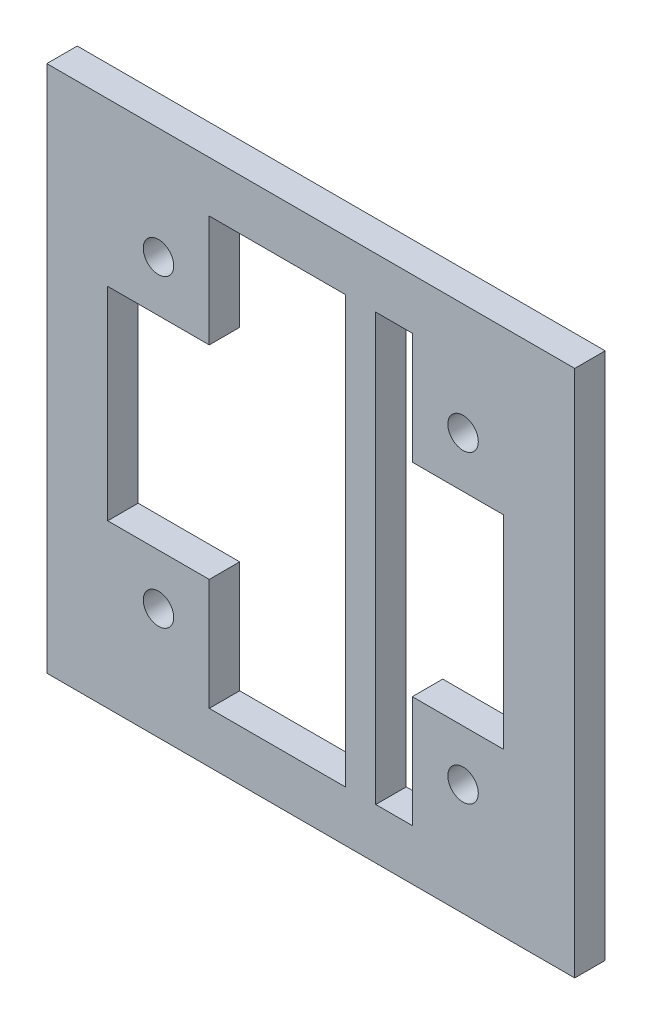
ISO-10303-21;
HEADER;
FILE_DESCRIPTION(('STEP AP214'),'2;1');
FILE_NAME('part.step','',(''),(''),'','','');
FILE_SCHEMA(('AUTOMOTIVE_DESIGN { 1 0 10303 214 1 1 1 1 }'));
ENDSEC;
DATA;
#1=APPLICATION_CONTEXT('core data for automotive mechanical design processes');
#2=APPLICATION_PROTOCOL_DEFINITION('international standard','automotive_design',2000,#1);
#3=PRODUCT_CONTEXT('',#1,'mechanical');
#4=PRODUCT('Part','Part','',(#3));
#5=PRODUCT_RELATED_PRODUCT_CATEGORY('part','',(#4));
#6=PRODUCT_DEFINITION_FORMATION('','',#4);
#7=PRODUCT_DEFINITION_CONTEXT('part definition',#1,'design');
#8=PRODUCT_DEFINITION('design','',#6,#7);
#9=PRODUCT_DEFINITION_SHAPE('','',#8);
#10=(LENGTH_UNIT() NAMED_UNIT(*) SI_UNIT(.MILLI.,.METRE.));
#11=(NAMED_UNIT(*) PLANE_ANGLE_UNIT() SI_UNIT($,.RADIAN.));
#12=(NAMED_UNIT(*) SI_UNIT($,.STERADIAN.) SOLID_ANGLE_UNIT());
#13=UNCERTAINTY_MEASURE_WITH_UNIT(LENGTH_MEASURE(1.E-05),#10,'distance_accuracy_value','');
#14=(GEOMETRIC_REPRESENTATION_CONTEXT(3) GLOBAL_UNCERTAINTY_ASSIGNED_CONTEXT((#13)) GLOBAL_UNIT_ASSIGNED_CONTEXT((#10,
#11,#12)) REPRESENTATION_CONTEXT('',''));
#15=CARTESIAN_POINT('',(0.,0.,0.));
#16=DIRECTION('',(0.,0.,1.));
#17=DIRECTION('',(1.,0.,0.));
#18=AXIS2_PLACEMENT_3D('',#15,#16,#17);
#19=CARTESIAN_POINT('',(72.4,0.,3.));
#20=DIRECTION('',(1.,0.,0.));
#21=DIRECTION('',(0.,0.,-1.));
#22=AXIS2_PLACEMENT_3D('',#19,#20,#21);
#23=PLANE('',#22);
#24=DIRECTION('',(0.,-1.,0.));
#25=VECTOR('',#24,1.);
#26=CARTESIAN_POINT('',(72.4,0.,0.));
#27=LINE('',#26,#25);
#28=CARTESIAN_POINT('',(72.4,226.,0.));
#29=VERTEX_POINT('',#28);
#30=CARTESIAN_POINT('',(72.4,184.,0.));
#31=VERTEX_POINT('',#30);
#32=EDGE_CURVE('E253',#29,#31,#27,.T.);
#33=ORIENTED_EDGE('',*,*,#32,.F.);
#34=DIRECTION('',(0.,0.,-1.));
#35=VECTOR('',#34,1.);
#36=CARTESIAN_POINT('',(72.4,226.,3.));
#37=LINE('',#36,#35);
#38=CARTESIAN_POINT('',(72.4,226.,3.));
#39=VERTEX_POINT('',#38);
#40=EDGE_CURVE('E11',#39,#29,#37,.T.);
#41=ORIENTED_EDGE('',*,*,#40,.F.);
#42=DIRECTION('',(0.,-1.,0.));
#43=VECTOR('',#42,1.);
#44=CARTESIAN_POINT('',(72.4,0.,3.));
#45=LINE('',#44,#43);
#46=CARTESIAN_POINT('',(72.4,184.,3.));
#47=VERTEX_POINT('',#46);
#48=EDGE_CURVE('E597',#39,#47,#45,.T.);
#49=ORIENTED_EDGE('',*,*,#48,.T.);
#50=DIRECTION('',(0.,0.,-1.));
#51=VECTOR('',#50,1.);
#52=CARTESIAN_POINT('',(72.4,184.,3.));
#53=LINE('',#52,#51);
#54=EDGE_CURVE('E51',#47,#31,#53,.T.);
#55=ORIENTED_EDGE('',*,*,#54,.T.);
#56=EDGE_LOOP('',(#33,#41,#49,#55));
#57=FACE_BOUND('',#56,.T.);
#58=ADVANCED_FACE('F32',(#57),#23,.T.);
#59=CARTESIAN_POINT('',(0.,226.,3.));
#60=DIRECTION('',(0.,1.,0.));
#61=DIRECTION('',(0.,0.,1.));
#62=AXIS2_PLACEMENT_3D('',#59,#60,#61);
#63=PLANE('',#62);
#64=DIRECTION('',(1.,0.,0.));
#65=VECTOR('',#64,1.);
#66=CARTESIAN_POINT('',(0.,226.,0.));
#67=LINE('',#66,#65);
#68=CARTESIAN_POINT('',(76.,226.,0.));
#69=VERTEX_POINT('',#68);
#70=EDGE_CURVE('E255',#29,#69,#67,.T.);
#71=ORIENTED_EDGE('',*,*,#70,.T.);
#72=DIRECTION('',(0.,0.,-1.));
#73=VECTOR('',#72,1.);
#74=CARTESIAN_POINT('',(76.,226.,3.));
#75=LINE('',#74,#73);
#76=CARTESIAN_POINT('',(76.,226.,3.));
#77=VERTEX_POINT('',#76);
#78=EDGE_CURVE('E42',#77,#69,#75,.T.);
#79=ORIENTED_EDGE('',*,*,#78,.F.);
#80=DIRECTION('',(1.,0.,0.));
#81=VECTOR('',#80,1.);
#82=CARTESIAN_POINT('',(0.,226.,3.));
#83=LINE('',#82,#81);
#84=EDGE_CURVE('E595',#39,#77,#83,.T.);
#85=ORIENTED_EDGE('',*,*,#84,.F.);
#86=ORIENTED_EDGE('',*,*,#40,.T.);
#87=EDGE_LOOP('',(#71,#79,#85,#86));
#88=FACE_BOUND('',#87,.T.);
#89=ADVANCED_FACE('F358',(#88),#63,.F.);
#90=CARTESIAN_POINT('',(76.,0.,3.));
#91=DIRECTION('',(1.,0.,0.));
#92=DIRECTION('',(0.,0.,-1.));
#93=AXIS2_PLACEMENT_3D('',#90,#91,#92);
#94=PLANE('',#93);
#95=DIRECTION('',(0.,-1.,0.));
#96=VECTOR('',#95,1.);
#97=CARTESIAN_POINT('',(76.,0.,0.));
#98=LINE('',#97,#96);
#99=CARTESIAN_POINT('',(76.,215.,0.));
#100=VERTEX_POINT('',#99);
#101=EDGE_CURVE('E258',#69,#100,#98,.T.);
#102=ORIENTED_EDGE('',*,*,#101,.T.);
#103=DIRECTION('',(0.,0.,-1.));
#104=VECTOR('',#103,1.);
#105=CARTESIAN_POINT('',(76.,215.,3.));
#106=LINE('',#105,#104);
#107=CARTESIAN_POINT('',(76.,215.,3.));
#108=VERTEX_POINT('',#107);
#109=EDGE_CURVE('E280',#108,#100,#106,.T.);
#110=ORIENTED_EDGE('',*,*,#109,.F.);
#111=DIRECTION('',(0.,-1.,0.));
#112=VECTOR('',#111,1.);
#113=CARTESIAN_POINT('',(76.,0.,3.));
#114=LINE('',#113,#112);
#115=EDGE_CURVE('E592',#77,#108,#114,.T.);
#116=ORIENTED_EDGE('',*,*,#115,.F.);
#117=ORIENTED_EDGE('',*,*,#78,.T.);
#118=EDGE_LOOP('',(#102,#110,#116,#117));
#119=FACE_BOUND('',#118,.T.);
#120=ADVANCED_FACE('F363',(#119),#94,.F.);
#121=CARTESIAN_POINT('',(0.,215.,3.));
#122=DIRECTION('',(0.,1.,0.));
#123=DIRECTION('',(0.,0.,1.));
#124=AXIS2_PLACEMENT_3D('',#121,#122,#123);
#125=PLANE('',#124);
#126=DIRECTION('',(1.,0.,0.));
#127=VECTOR('',#126,1.);
#128=CARTESIAN_POINT('',(0.,215.,0.));
#129=LINE('',#128,#127);
#130=CARTESIAN_POINT('',(85.,215.,0.));
#131=VERTEX_POINT('',#130);
#132=EDGE_CURVE('E261',#100,#131,#129,.T.);
#133=ORIENTED_EDGE('',*,*,#132,.T.);
#134=DIRECTION('',(0.,0.,-1.));
#135=VECTOR('',#134,1.);
#136=CARTESIAN_POINT('',(85.,215.,3.));
#137=LINE('',#136,#135);
#138=CARTESIAN_POINT('',(85.,215.,3.));
#139=VERTEX_POINT('',#138);
#140=EDGE_CURVE('E278',#139,#131,#137,.T.);
#141=ORIENTED_EDGE('',*,*,#140,.F.);
#142=DIRECTION('',(1.,0.,0.));
#143=VECTOR('',#142,1.);
#144=CARTESIAN_POINT('',(0.,215.,3.));
#145=LINE('',#144,#143);
#146=EDGE_CURVE('E200',#108,#139,#145,.T.);
#147=ORIENTED_EDGE('',*,*,#146,.F.);
#148=ORIENTED_EDGE('',*,*,#109,.T.);
#149=EDGE_LOOP('',(#133,#141,#147,#148));
#150=FACE_BOUND('',#149,.T.);
#151=ADVANCED_FACE('F553',(#150),#125,.F.);
#152=CARTESIAN_POINT('',(85.,0.,3.));
#153=DIRECTION('',(-1.,0.,0.));
#154=DIRECTION('',(0.,0.,1.));
#155=AXIS2_PLACEMENT_3D('',#152,#153,#154);
#156=PLANE('',#155);
#157=DIRECTION('',(0.,1.,0.));
#158=VECTOR('',#157,1.);
#159=CARTESIAN_POINT('',(85.,0.,0.));
#160=LINE('',#159,#158);
#161=CARTESIAN_POINT('',(85.,195.,0.));
#162=VERTEX_POINT('',#161);
#163=EDGE_CURVE('E264',#162,#131,#160,.T.);
#164=ORIENTED_EDGE('',*,*,#163,.F.);
#165=DIRECTION('',(0.,0.,-1.));
#166=VECTOR('',#165,1.);
#167=CARTESIAN_POINT('',(85.,195.,3.));
#168=LINE('',#167,#166);
#169=CARTESIAN_POINT('',(85.,195.,3.));
#170=VERTEX_POINT('',#169);
#171=EDGE_CURVE('E186',#170,#162,#168,.T.);
#172=ORIENTED_EDGE('',*,*,#171,.F.);
#173=DIRECTION('',(0.,1.,0.));
#174=VECTOR('',#173,1.);
#175=CARTESIAN_POINT('',(85.,0.,3.));
#176=LINE('',#175,#174);
#177=EDGE_CURVE('E198',#170,#139,#176,.T.);
#178=ORIENTED_EDGE('',*,*,#177,.T.);
#179=ORIENTED_EDGE('',*,*,#140,.T.);
#180=EDGE_LOOP('',(#164,#172,#178,#179));
#181=FACE_BOUND('',#180,.T.);
#182=ADVANCED_FACE('F544',(#181),#156,.T.);
#183=CARTESIAN_POINT('',(0.,195.,3.));
#184=DIRECTION('',(0.,1.,0.));
#185=DIRECTION('',(0.,0.,1.));
#186=AXIS2_PLACEMENT_3D('',#183,#184,#185);
#187=PLANE('',#186);
#188=DIRECTION('',(1.,0.,0.));
#189=VECTOR('',#188,1.);
#190=CARTESIAN_POINT('',(0.,195.,0.));
#191=LINE('',#190,#189);
#192=CARTESIAN_POINT('',(76.,195.,0.));
#193=VERTEX_POINT('',#192);
#194=EDGE_CURVE('E183',#193,#162,#191,.T.);
#195=ORIENTED_EDGE('',*,*,#194,.F.);
#196=DIRECTION('',(0.,0.,-1.));
#197=VECTOR('',#196,1.);
#198=CARTESIAN_POINT('',(76.,195.,3.));
#199=LINE('',#198,#197);
#200=CARTESIAN_POINT('',(76.,195.,3.));
#201=VERTEX_POINT('',#200);
#202=EDGE_CURVE('E177',#201,#193,#199,.T.);
#203=ORIENTED_EDGE('',*,*,#202,.F.);
#204=DIRECTION('',(1.,0.,0.));
#205=VECTOR('',#204,1.);
#206=CARTESIAN_POINT('',(0.,195.,3.));
#207=LINE('',#206,#205);
#208=EDGE_CURVE('E181',#201,#170,#207,.T.);
#209=ORIENTED_EDGE('',*,*,#208,.T.);
#210=ORIENTED_EDGE('',*,*,#171,.T.);
#211=EDGE_LOOP('',(#195,#203,#209,#210));
#212=FACE_BOUND('',#211,.T.);
#213=ADVANCED_FACE('F179',(#212),#187,.T.);
#214=CARTESIAN_POINT('',(76.,0.,3.));
#215=DIRECTION('',(1.,0.,0.));
#216=DIRECTION('',(0.,0.,-1.));
#217=AXIS2_PLACEMENT_3D('',#214,#215,#216);
#218=PLANE('',#217);
#219=DIRECTION('',(0.,-1.,0.));
#220=VECTOR('',#219,1.);
#221=CARTESIAN_POINT('',(76.,0.,0.));
#222=LINE('',#221,#220);
#223=CARTESIAN_POINT('',(76.,184.,0.));
#224=VERTEX_POINT('',#223);
#225=EDGE_CURVE('E268',#193,#224,#222,.T.);
#226=ORIENTED_EDGE('',*,*,#225,.T.);
#227=DIRECTION('',(0.,0.,-1.));
#228=VECTOR('',#227,1.);
#229=CARTESIAN_POINT('',(76.,184.,3.));
#230=LINE('',#229,#228);
#231=CARTESIAN_POINT('',(76.,184.,3.));
#232=VERTEX_POINT('',#231);
#233=EDGE_CURVE('E113',#232,#224,#230,.T.);
#234=ORIENTED_EDGE('',*,*,#233,.F.);
#235=DIRECTION('',(0.,-1.,0.));
#236=VECTOR('',#235,1.);
#237=CARTESIAN_POINT('',(76.,0.,3.));
#238=LINE('',#237,#236);
#239=EDGE_CURVE('E188',#201,#232,#238,.T.);
#240=ORIENTED_EDGE('',*,*,#239,.F.);
#241=ORIENTED_EDGE('',*,*,#202,.T.);
#242=EDGE_LOOP('',(#226,#234,#240,#241));
#243=FACE_BOUND('',#242,.T.);
#244=ADVANCED_FACE('F189',(#243),#218,.F.);
#245=CARTESIAN_POINT('',(40.,0.,3.));
#246=DIRECTION('',(1.,0.,0.));
#247=DIRECTION('',(0.,0.,-1.));
#248=AXIS2_PLACEMENT_3D('',#245,#246,#247);
#249=PLANE('',#248);
#250=DIRECTION('',(0.,-1.,0.));
#251=VECTOR('',#250,1.);
#252=CARTESIAN_POINT('',(40.,0.,0.));
#253=LINE('',#252,#251);
#254=CARTESIAN_POINT('',(40.,231.,0.));
#255=VERTEX_POINT('',#254);
#256=CARTESIAN_POINT('',(40.,179.,0.));
#257=VERTEX_POINT('',#256);
#258=EDGE_CURVE('E242',#255,#257,#253,.T.);
#259=ORIENTED_EDGE('',*,*,#258,.T.);
#260=DIRECTION('',(0.,0.,-1.));
#261=VECTOR('',#260,1.);
#262=CARTESIAN_POINT('',(40.,179.,3.));
#263=LINE('',#262,#261);
#264=CARTESIAN_POINT('',(40.,179.,3.));
#265=VERTEX_POINT('',#264);
#266=EDGE_CURVE('E275',#265,#257,#263,.T.);
#267=ORIENTED_EDGE('',*,*,#266,.F.);
#268=DIRECTION('',(0.,-1.,0.));
#269=VECTOR('',#268,1.);
#270=CARTESIAN_POINT('',(40.,0.,3.));
#271=LINE('',#270,#269);
#272=CARTESIAN_POINT('',(40.,231.,3.));
#273=VERTEX_POINT('',#272);
#274=EDGE_CURVE('E608',#273,#265,#271,.T.);
#275=ORIENTED_EDGE('',*,*,#274,.F.);
#276=DIRECTION('',(0.,0.,-1.));
#277=VECTOR('',#276,1.);
#278=CARTESIAN_POINT('',(40.,231.,3.));
#279=LINE('',#278,#277);
#280=EDGE_CURVE('E285',#273,#255,#279,.T.);
#281=ORIENTED_EDGE('',*,*,#280,.T.);
#282=EDGE_LOOP('',(#259,#267,#275,#281));
#283=FACE_BOUND('',#282,.T.);
#284=ADVANCED_FACE('F379',(#283),#249,.F.);
#285=CARTESIAN_POINT('',(0.,179.,3.));
#286=DIRECTION('',(0.,1.,0.));
#287=DIRECTION('',(0.,0.,1.));
#288=AXIS2_PLACEMENT_3D('',#285,#286,#287);
#289=PLANE('',#288);
#290=DIRECTION('',(1.,0.,0.));
#291=VECTOR('',#290,1.);
#292=CARTESIAN_POINT('',(0.,179.,0.));
#293=LINE('',#292,#291);
#294=CARTESIAN_POINT('',(92.,179.,0.));
#295=VERTEX_POINT('',#294);
#296=EDGE_CURVE('E245',#257,#295,#293,.T.);
#297=ORIENTED_EDGE('',*,*,#296,.T.);
#298=DIRECTION('',(0.,0.,-1.));
#299=VECTOR('',#298,1.);
#300=CARTESIAN_POINT('',(92.,179.,3.));
#301=LINE('',#300,#299);
#302=CARTESIAN_POINT('',(92.,179.,3.));
#303=VERTEX_POINT('',#302);
#304=EDGE_CURVE('E289',#303,#295,#301,.T.);
#305=ORIENTED_EDGE('',*,*,#304,.F.);
#306=DIRECTION('',(1.,0.,0.));
#307=VECTOR('',#306,1.);
#308=CARTESIAN_POINT('',(0.,179.,3.));
#309=LINE('',#308,#307);
#310=EDGE_CURVE('E606',#265,#303,#309,.T.);
#311=ORIENTED_EDGE('',*,*,#310,.F.);
#312=ORIENTED_EDGE('',*,*,#266,.T.);
#313=EDGE_LOOP('',(#297,#305,#311,#312));
#314=FACE_BOUND('',#313,.T.);
#315=ADVANCED_FACE('F375',(#314),#289,.F.);
#316=CARTESIAN_POINT('',(92.,0.,3.));
#317=DIRECTION('',(-1.,0.,0.));
#318=DIRECTION('',(0.,0.,1.));
#319=AXIS2_PLACEMENT_3D('',#316,#317,#318);
#320=PLANE('',#319);
#321=DIRECTION('',(0.,1.,0.));
#322=VECTOR('',#321,1.);
#323=CARTESIAN_POINT('',(92.,0.,0.));
#324=LINE('',#323,#322);
#325=CARTESIAN_POINT('',(92.,231.,0.));
#326=VERTEX_POINT('',#325);
#327=EDGE_CURVE('E247',#295,#326,#324,.T.);
#328=ORIENTED_EDGE('',*,*,#327,.T.);
#329=DIRECTION('',(0.,0.,-1.));
#330=VECTOR('',#329,1.);
#331=CARTESIAN_POINT('',(92.,231.,3.));
#332=LINE('',#331,#330);
#333=CARTESIAN_POINT('',(92.,231.,3.));
#334=VERTEX_POINT('',#333);
#335=EDGE_CURVE('E287',#334,#326,#332,.T.);
#336=ORIENTED_EDGE('',*,*,#335,.F.);
#337=DIRECTION('',(0.,1.,0.));
#338=VECTOR('',#337,1.);
#339=CARTESIAN_POINT('',(92.,0.,3.));
#340=LINE('',#339,#338);
#341=EDGE_CURVE('E604',#303,#334,#340,.T.);
#342=ORIENTED_EDGE('',*,*,#341,.F.);
#343=ORIENTED_EDGE('',*,*,#304,.T.);
#344=EDGE_LOOP('',(#328,#336,#342,#343));
#345=FACE_BOUND('',#344,.T.);
#346=ADVANCED_FACE('F372',(#345),#320,.F.);
#347=CARTESIAN_POINT('',(56.,0.,3.));
#348=DIRECTION('',(1.,0.,0.));
#349=DIRECTION('',(0.,0.,-1.));
#350=AXIS2_PLACEMENT_3D('',#347,#348,#349);
#351=PLANE('',#350);
#352=DIRECTION('',(0.,-1.,0.));
#353=VECTOR('',#352,1.);
#354=CARTESIAN_POINT('',(56.,0.,0.));
#355=LINE('',#354,#353);
#356=CARTESIAN_POINT('',(56.,226.,0.));
#357=VERTEX_POINT('',#356);
#358=CARTESIAN_POINT('',(56.,215.,0.));
#359=VERTEX_POINT('',#358);
#360=EDGE_CURVE('E218',#357,#359,#355,.T.);
#361=ORIENTED_EDGE('',*,*,#360,.F.);
#362=DIRECTION('',(0.,0.,-1.));
#363=VECTOR('',#362,1.);
#364=CARTESIAN_POINT('',(56.,226.,3.));
#365=LINE('',#364,#363);
#366=CARTESIAN_POINT('',(56.,226.,3.));
#367=VERTEX_POINT('',#366);
#368=EDGE_CURVE('E36',#367,#357,#365,.T.);
#369=ORIENTED_EDGE('',*,*,#368,.F.);
#370=DIRECTION('',(0.,-1.,0.));
#371=VECTOR('',#370,1.);
#372=CARTESIAN_POINT('',(56.,0.,3.));
#373=LINE('',#372,#371);
#374=CARTESIAN_POINT('',(56.,215.,3.));
#375=VERTEX_POINT('',#374);
#376=EDGE_CURVE('E320',#367,#375,#373,.T.);
#377=ORIENTED_EDGE('',*,*,#376,.T.);
#378=DIRECTION('',(0.,0.,-1.));
#379=VECTOR('',#378,1.);
#380=CARTESIAN_POINT('',(56.,215.,3.));
#381=LINE('',#380,#379);
#382=EDGE_CURVE('E205',#375,#359,#381,.T.);
#383=ORIENTED_EDGE('',*,*,#382,.T.);
#384=EDGE_LOOP('',(#361,#369,#377,#383));
#385=FACE_BOUND('',#384,.T.);
#386=ADVANCED_FACE('F318',(#385),#351,.T.);
#387=CARTESIAN_POINT('',(0.,226.,3.));
#388=DIRECTION('',(0.,1.,0.));
#389=DIRECTION('',(0.,0.,1.));
#390=AXIS2_PLACEMENT_3D('',#387,#388,#389);
#391=PLANE('',#390);
#392=DIRECTION('',(1.,0.,0.));
#393=VECTOR('',#392,1.);
#394=CARTESIAN_POINT('',(0.,226.,0.));
#395=LINE('',#394,#393);
#396=CARTESIAN_POINT('',(69.4,226.,0.));
#397=VERTEX_POINT('',#396);
#398=EDGE_CURVE('E221',#357,#397,#395,.T.);
#399=ORIENTED_EDGE('',*,*,#398,.T.);
#400=DIRECTION('',(0.,0.,-1.));
#401=VECTOR('',#400,1.);
#402=CARTESIAN_POINT('',(69.4,226.,3.));
#403=LINE('',#402,#401);
#404=CARTESIAN_POINT('',(69.4,226.,3.));
#405=VERTEX_POINT('',#404);
#406=EDGE_CURVE('E304',#405,#397,#403,.T.);
#407=ORIENTED_EDGE('',*,*,#406,.F.);
#408=DIRECTION('',(1.,0.,0.));
#409=VECTOR('',#408,1.);
#410=CARTESIAN_POINT('',(0.,226.,3.));
#411=LINE('',#410,#409);
#412=EDGE_CURVE('E312',#367,#405,#411,.T.);
#413=ORIENTED_EDGE('',*,*,#412,.F.);
#414=ORIENTED_EDGE('',*,*,#368,.T.);
#415=EDGE_LOOP('',(#399,#407,#413,#414));
#416=FACE_BOUND('',#415,.T.);
#417=ADVANCED_FACE('F310',(#416),#391,.F.);
#418=CARTESIAN_POINT('',(69.4,0.,3.));
#419=DIRECTION('',(1.,0.,0.));
#420=DIRECTION('',(0.,0.,-1.));
#421=AXIS2_PLACEMENT_3D('',#418,#419,#420);
#422=PLANE('',#421);
#423=DIRECTION('',(0.,-1.,0.));
#424=VECTOR('',#423,1.);
#425=CARTESIAN_POINT('',(69.4,0.,0.));
#426=LINE('',#425,#424);
#427=CARTESIAN_POINT('',(69.4,184.,0.));
#428=VERTEX_POINT('',#427);
#429=EDGE_CURVE('E224',#397,#428,#426,.T.);
#430=ORIENTED_EDGE('',*,*,#429,.T.);
#431=DIRECTION('',(0.,0.,-1.));
#432=VECTOR('',#431,1.);
#433=CARTESIAN_POINT('',(69.4,184.,3.));
#434=LINE('',#433,#432);
#435=CARTESIAN_POINT('',(69.4,184.,3.));
#436=VERTEX_POINT('',#435);
#437=EDGE_CURVE('E303',#436,#428,#434,.T.);
#438=ORIENTED_EDGE('',*,*,#437,.F.);
#439=DIRECTION('',(0.,-1.,0.));
#440=VECTOR('',#439,1.);
#441=CARTESIAN_POINT('',(69.4,0.,3.));
#442=LINE('',#441,#440);
#443=EDGE_CURVE('E618',#405,#436,#442,.T.);
#444=ORIENTED_EDGE('',*,*,#443,.F.);
#445=ORIENTED_EDGE('',*,*,#406,.T.);
#446=EDGE_LOOP('',(#430,#438,#444,#445));
#447=FACE_BOUND('',#446,.T.);
#448=ADVANCED_FACE('F348',(#447),#422,.F.);
#449=CARTESIAN_POINT('',(0.,184.,3.));
#450=DIRECTION('',(0.,1.,0.));
#451=DIRECTION('',(0.,0.,1.));
#452=AXIS2_PLACEMENT_3D('',#449,#450,#451);
#453=PLANE('',#452);
#454=DIRECTION('',(1.,0.,0.));
#455=VECTOR('',#454,1.);
#456=CARTESIAN_POINT('',(0.,184.,0.));
#457=LINE('',#456,#455);
#458=CARTESIAN_POINT('',(56.,184.,0.));
#459=VERTEX_POINT('',#458);
#460=EDGE_CURVE('E227',#459,#428,#457,.T.);
#461=ORIENTED_EDGE('',*,*,#460,.F.);
#462=DIRECTION('',(0.,0.,-1.));
#463=VECTOR('',#462,1.);
#464=CARTESIAN_POINT('',(56.,184.,3.));
#465=LINE('',#464,#463);
#466=CARTESIAN_POINT('',(56.,184.,3.));
#467=VERTEX_POINT('',#466);
#468=EDGE_CURVE('E301',#467,#459,#465,.T.);
#469=ORIENTED_EDGE('',*,*,#468,.F.);
#470=DIRECTION('',(1.,0.,0.));
#471=VECTOR('',#470,1.);
#472=CARTESIAN_POINT('',(0.,184.,3.));
#473=LINE('',#472,#471);
#474=EDGE_CURVE('E347',#467,#436,#473,.T.);
#475=ORIENTED_EDGE('',*,*,#474,.T.);
#476=ORIENTED_EDGE('',*,*,#437,.T.);
#477=EDGE_LOOP('',(#461,#469,#475,#476));
#478=FACE_BOUND('',#477,.T.);
#479=ADVANCED_FACE('F345',(#478),#453,.T.);
#480=CARTESIAN_POINT('',(56.,0.,3.));
#481=DIRECTION('',(1.,0.,0.));
#482=DIRECTION('',(0.,0.,-1.));
#483=AXIS2_PLACEMENT_3D('',#480,#481,#482);
#484=PLANE('',#483);
#485=DIRECTION('',(0.,-1.,0.));
#486=VECTOR('',#485,1.);
#487=CARTESIAN_POINT('',(56.,0.,0.));
#488=LINE('',#487,#486);
#489=CARTESIAN_POINT('',(56.,195.,0.));
#490=VERTEX_POINT('',#489);
#491=EDGE_CURVE('E230',#490,#459,#488,.T.);
#492=ORIENTED_EDGE('',*,*,#491,.F.);
#493=DIRECTION('',(0.,0.,-1.));
#494=VECTOR('',#493,1.);
#495=CARTESIAN_POINT('',(56.,195.,3.));
#496=LINE('',#495,#494);
#497=CARTESIAN_POINT('',(56.,195.,3.));
#498=VERTEX_POINT('',#497);
#499=EDGE_CURVE('E299',#498,#490,#496,.T.);
#500=ORIENTED_EDGE('',*,*,#499,.F.);
#501=DIRECTION('',(0.,-1.,0.));
#502=VECTOR('',#501,1.);
#503=CARTESIAN_POINT('',(56.,0.,3.));
#504=LINE('',#503,#502);
#505=EDGE_CURVE('E341',#498,#467,#504,.T.);
#506=ORIENTED_EDGE('',*,*,#505,.T.);
#507=ORIENTED_EDGE('',*,*,#468,.T.);
#508=EDGE_LOOP('',(#492,#500,#506,#507));
#509=FACE_BOUND('',#508,.T.);
#510=ADVANCED_FACE('F338',(#509),#484,.T.);
#511=CARTESIAN_POINT('',(0.,195.,3.));
#512=DIRECTION('',(0.,1.,0.));
#513=DIRECTION('',(0.,0.,1.));
#514=AXIS2_PLACEMENT_3D('',#511,#512,#513);
#515=PLANE('',#514);
#516=DIRECTION('',(1.,0.,0.));
#517=VECTOR('',#516,1.);
#518=CARTESIAN_POINT('',(0.,195.,0.));
#519=LINE('',#518,#517);
#520=CARTESIAN_POINT('',(46.,195.,0.));
#521=VERTEX_POINT('',#520);
#522=EDGE_CURVE('E233',#521,#490,#519,.T.);
#523=ORIENTED_EDGE('',*,*,#522,.F.);
#524=DIRECTION('',(0.,0.,-1.));
#525=VECTOR('',#524,1.);
#526=CARTESIAN_POINT('',(46.,195.,3.));
#527=LINE('',#526,#525);
#528=CARTESIAN_POINT('',(46.,195.,3.));
#529=VERTEX_POINT('',#528);
#530=EDGE_CURVE('E297',#529,#521,#527,.T.);
#531=ORIENTED_EDGE('',*,*,#530,.F.);
#532=DIRECTION('',(1.,0.,0.));
#533=VECTOR('',#532,1.);
#534=CARTESIAN_POINT('',(0.,195.,3.));
#535=LINE('',#534,#533);
#536=EDGE_CURVE('E614',#529,#498,#535,.T.);
#537=ORIENTED_EDGE('',*,*,#536,.T.);
#538=ORIENTED_EDGE('',*,*,#499,.T.);
#539=EDGE_LOOP('',(#523,#531,#537,#538));
#540=FACE_BOUND('',#539,.T.);
#541=ADVANCED_FACE('F334',(#540),#515,.T.);
#542=CARTESIAN_POINT('',(46.,0.,3.));
#543=DIRECTION('',(1.,0.,0.));
#544=DIRECTION('',(0.,0.,-1.));
#545=AXIS2_PLACEMENT_3D('',#542,#543,#544);
#546=PLANE('',#545);
#547=DIRECTION('',(0.,-1.,0.));
#548=VECTOR('',#547,1.);
#549=CARTESIAN_POINT('',(46.,0.,0.));
#550=LINE('',#549,#548);
#551=CARTESIAN_POINT('',(46.,215.,0.));
#552=VERTEX_POINT('',#551);
#553=EDGE_CURVE('E236',#552,#521,#550,.T.);
#554=ORIENTED_EDGE('',*,*,#553,.F.);
#555=DIRECTION('',(0.,0.,-1.));
#556=VECTOR('',#555,1.);
#557=CARTESIAN_POINT('',(46.,215.,3.));
#558=LINE('',#557,#556);
#559=CARTESIAN_POINT('',(46.,215.,3.));
#560=VERTEX_POINT('',#559);
#561=EDGE_CURVE('E295',#560,#552,#558,.T.);
#562=ORIENTED_EDGE('',*,*,#561,.F.);
#563=DIRECTION('',(0.,-1.,0.));
#564=VECTOR('',#563,1.);
#565=CARTESIAN_POINT('',(46.,0.,3.));
#566=LINE('',#565,#564);
#567=EDGE_CURVE('E330',#560,#529,#566,.T.);
#568=ORIENTED_EDGE('',*,*,#567,.T.);
#569=ORIENTED_EDGE('',*,*,#530,.T.);
#570=EDGE_LOOP('',(#554,#562,#568,#569));
#571=FACE_BOUND('',#570,.T.);
#572=ADVANCED_FACE('F326',(#571),#546,.T.);
#573=CARTESIAN_POINT('',(0.,231.,3.));
#574=DIRECTION('',(0.,1.,0.));
#575=DIRECTION('',(0.,0.,1.));
#576=AXIS2_PLACEMENT_3D('',#573,#574,#575);
#577=PLANE('',#576);
#578=DIRECTION('',(1.,0.,0.));
#579=VECTOR('',#578,1.);
#580=CARTESIAN_POINT('',(0.,231.,0.));
#581=LINE('',#580,#579);
#582=EDGE_CURVE('E250',#255,#326,#581,.T.);
#583=ORIENTED_EDGE('',*,*,#582,.F.);
#584=ORIENTED_EDGE('',*,*,#280,.F.);
#585=DIRECTION('',(1.,0.,0.));
#586=VECTOR('',#585,1.);
#587=CARTESIAN_POINT('',(0.,231.,3.));
#588=LINE('',#587,#586);
#589=EDGE_CURVE('E601',#273,#334,#588,.T.);
#590=ORIENTED_EDGE('',*,*,#589,.T.);
#591=ORIENTED_EDGE('',*,*,#335,.T.);
#592=EDGE_LOOP('',(#583,#584,#590,#591));
#593=FACE_BOUND('',#592,.T.);
#594=ADVANCED_FACE('F368',(#593),#577,.T.);
#595=CARTESIAN_POINT('',(0.,215.,3.));
#596=DIRECTION('',(0.,1.,0.));
#597=DIRECTION('',(0.,0.,1.));
#598=AXIS2_PLACEMENT_3D('',#595,#596,#597);
#599=PLANE('',#598);
#600=DIRECTION('',(1.,0.,0.));
#601=VECTOR('',#600,1.);
#602=CARTESIAN_POINT('',(0.,215.,0.));
#603=LINE('',#602,#601);
#604=EDGE_CURVE('E239',#552,#359,#603,.T.);
#605=ORIENTED_EDGE('',*,*,#604,.T.);
#606=ORIENTED_EDGE('',*,*,#382,.F.);
#607=DIRECTION('',(1.,0.,0.));
#608=VECTOR('',#607,1.);
#609=CARTESIAN_POINT('',(0.,215.,3.));
#610=LINE('',#609,#608);
#611=EDGE_CURVE('E611',#560,#375,#610,.T.);
#612=ORIENTED_EDGE('',*,*,#611,.F.);
#613=ORIENTED_EDGE('',*,*,#561,.T.);
#614=EDGE_LOOP('',(#605,#606,#612,#613));
#615=FACE_BOUND('',#614,.T.);
#616=ADVANCED_FACE('F323',(#615),#599,.F.);
#617=CARTESIAN_POINT('',(51.,220.,3.));
#618=DIRECTION('',(0.,0.,-1.));
#619=DIRECTION('',(-1.,0.,0.));
#620=AXIS2_PLACEMENT_3D('',#617,#618,#619);
#621=CYLINDRICAL_SURFACE('',#620,1.5);
#622=CARTESIAN_POINT('',(51.,220.,3.));
#623=DIRECTION('',(0.,0.,1.));
#624=DIRECTION('',(1.,0.,0.));
#625=AXIS2_PLACEMENT_3D('',#622,#623,#624);
#626=CIRCLE('',#625,1.5);
#627=CARTESIAN_POINT('',(52.5,220.,3.));
#628=VERTEX_POINT('',#627);
#629=EDGE_CURVE('E622',#628,#628,#626,.T.);
#630=ORIENTED_EDGE('',*,*,#629,.T.);
#631=EDGE_LOOP('',(#630));
#632=FACE_BOUND('',#631,.T.);
#633=CARTESIAN_POINT('',(51.,220.,0.));
#634=DIRECTION('',(0.,0.,1.));
#635=DIRECTION('',(1.,0.,0.));
#636=AXIS2_PLACEMENT_3D('',#633,#634,#635);
#637=CIRCLE('',#636,1.5);
#638=CARTESIAN_POINT('',(52.5,220.,0.));
#639=VERTEX_POINT('',#638);
#640=EDGE_CURVE('E215',#639,#639,#637,.T.);
#641=ORIENTED_EDGE('',*,*,#640,.F.);
#642=EDGE_LOOP('',(#641));
#643=FACE_BOUND('',#642,.T.);
#644=ADVANCED_FACE('F386',(#632,#643),#621,.F.);
#645=CARTESIAN_POINT('',(81.,220.,3.));
#646=DIRECTION('',(0.,0.,-1.));
#647=DIRECTION('',(-1.,0.,0.));
#648=AXIS2_PLACEMENT_3D('',#645,#646,#647);
#649=CYLINDRICAL_SURFACE('',#648,1.5);
#650=CARTESIAN_POINT('',(81.,220.,3.));
#651=DIRECTION('',(0.,0.,1.));
#652=DIRECTION('',(1.,0.,0.));
#653=AXIS2_PLACEMENT_3D('',#650,#651,#652);
#654=CIRCLE('',#653,1.5);
#655=CARTESIAN_POINT('',(82.5,220.,3.));
#656=VERTEX_POINT('',#655);
#657=EDGE_CURVE('E625',#656,#656,#654,.T.);
#658=ORIENTED_EDGE('',*,*,#657,.T.);
#659=EDGE_LOOP('',(#658));
#660=FACE_BOUND('',#659,.T.);
#661=CARTESIAN_POINT('',(81.,220.,0.));
#662=DIRECTION('',(0.,0.,1.));
#663=DIRECTION('',(1.,0.,0.));
#664=AXIS2_PLACEMENT_3D('',#661,#662,#663);
#665=CIRCLE('',#664,1.5);
#666=CARTESIAN_POINT('',(82.5,220.,0.));
#667=VERTEX_POINT('',#666);
#668=EDGE_CURVE('E212',#667,#667,#665,.T.);
#669=ORIENTED_EDGE('',*,*,#668,.F.);
#670=EDGE_LOOP('',(#669));
#671=FACE_BOUND('',#670,.T.);
#672=ADVANCED_FACE('F418',(#660,#671),#649,.F.);
#673=CARTESIAN_POINT('',(81.,190.,3.));
#674=DIRECTION('',(0.,0.,-1.));
#675=DIRECTION('',(-1.,0.,0.));
#676=AXIS2_PLACEMENT_3D('',#673,#674,#675);
#677=CYLINDRICAL_SURFACE('',#676,1.5);
#678=CARTESIAN_POINT('',(81.,190.,3.));
#679=DIRECTION('',(0.,0.,1.));
#680=DIRECTION('',(1.,0.,0.));
#681=AXIS2_PLACEMENT_3D('',#678,#679,#680);
#682=CIRCLE('',#681,1.5);
#683=CARTESIAN_POINT('',(82.5,190.,3.));
#684=VERTEX_POINT('',#683);
#685=EDGE_CURVE('E628',#684,#684,#682,.T.);
#686=ORIENTED_EDGE('',*,*,#685,.T.);
#687=EDGE_LOOP('',(#686));
#688=FACE_BOUND('',#687,.T.);
#689=CARTESIAN_POINT('',(81.,190.,0.));
#690=DIRECTION('',(0.,0.,1.));
#691=DIRECTION('',(1.,0.,0.));
#692=AXIS2_PLACEMENT_3D('',#689,#690,#691);
#693=CIRCLE('',#692,1.5);
#694=CARTESIAN_POINT('',(82.5,190.,0.));
#695=VERTEX_POINT('',#694);
#696=EDGE_CURVE('E209',#695,#695,#693,.T.);
#697=ORIENTED_EDGE('',*,*,#696,.F.);
#698=EDGE_LOOP('',(#697));
#699=FACE_BOUND('',#698,.T.);
#700=ADVANCED_FACE('F426',(#688,#699),#677,.F.);
#701=CARTESIAN_POINT('',(51.,190.,3.));
#702=DIRECTION('',(0.,0.,-1.));
#703=DIRECTION('',(-1.,0.,0.));
#704=AXIS2_PLACEMENT_3D('',#701,#702,#703);
#705=CYLINDRICAL_SURFACE('',#704,1.5);
#706=CARTESIAN_POINT('',(51.,190.,3.));
#707=DIRECTION('',(0.,0.,1.));
#708=DIRECTION('',(1.,0.,0.));
#709=AXIS2_PLACEMENT_3D('',#706,#707,#708);
#710=CIRCLE('',#709,1.5);
#711=CARTESIAN_POINT('',(52.5,190.,3.));
#712=VERTEX_POINT('',#711);
#713=EDGE_CURVE('E273',#712,#712,#710,.T.);
#714=ORIENTED_EDGE('',*,*,#713,.T.);
#715=EDGE_LOOP('',(#714));
#716=FACE_BOUND('',#715,.T.);
#717=CARTESIAN_POINT('',(51.,190.,0.));
#718=DIRECTION('',(0.,0.,1.));
#719=DIRECTION('',(1.,0.,0.));
#720=AXIS2_PLACEMENT_3D('',#717,#718,#719);
#721=CIRCLE('',#720,1.5);
#722=CARTESIAN_POINT('',(52.5,190.,0.));
#723=VERTEX_POINT('',#722);
#724=EDGE_CURVE('E206',#723,#723,#721,.T.);
#725=ORIENTED_EDGE('',*,*,#724,.F.);
#726=EDGE_LOOP('',(#725));
#727=FACE_BOUND('',#726,.T.);
#728=ADVANCED_FACE('F34',(#716,#727),#705,.F.);
#729=CARTESIAN_POINT('',(0.,184.,3.));
#730=DIRECTION('',(0.,1.,0.));
#731=DIRECTION('',(0.,0.,1.));
#732=AXIS2_PLACEMENT_3D('',#729,#730,#731);
#733=PLANE('',#732);
#734=DIRECTION('',(1.,0.,0.));
#735=VECTOR('',#734,1.);
#736=CARTESIAN_POINT('',(0.,184.,0.));
#737=LINE('',#736,#735);
#738=EDGE_CURVE('E270',#31,#224,#737,.T.);
#739=ORIENTED_EDGE('',*,*,#738,.F.);
#740=ORIENTED_EDGE('',*,*,#54,.F.);
#741=DIRECTION('',(1.,0.,0.));
#742=VECTOR('',#741,1.);
#743=CARTESIAN_POINT('',(0.,184.,3.));
#744=LINE('',#743,#742);
#745=EDGE_CURVE('E192',#47,#232,#744,.T.);
#746=ORIENTED_EDGE('',*,*,#745,.T.);
#747=ORIENTED_EDGE('',*,*,#233,.T.);
#748=EDGE_LOOP('',(#739,#740,#746,#747));
#749=FACE_BOUND('',#748,.T.);
#750=ADVANCED_FACE('F440',(#749),#733,.T.);
#751=CARTESIAN_POINT('',(0.,0.,3.));
#752=DIRECTION('',(0.,0.,1.));
#753=DIRECTION('',(1.,0.,0.));
#754=AXIS2_PLACEMENT_3D('',#751,#752,#753);
#755=PLANE('',#754);
#756=ORIENTED_EDGE('',*,*,#713,.F.);
#757=EDGE_LOOP('',(#756));
#758=FACE_BOUND('',#757,.T.);
#759=ORIENTED_EDGE('',*,*,#685,.F.);
#760=EDGE_LOOP('',(#759));
#761=FACE_BOUND('',#760,.T.);
#762=ORIENTED_EDGE('',*,*,#657,.F.);
#763=EDGE_LOOP('',(#762));
#764=FACE_BOUND('',#763,.T.);
#765=ORIENTED_EDGE('',*,*,#629,.F.);
#766=EDGE_LOOP('',(#765));
#767=FACE_BOUND('',#766,.T.);
#768=ORIENTED_EDGE('',*,*,#376,.F.);
#769=ORIENTED_EDGE('',*,*,#412,.T.);
#770=ORIENTED_EDGE('',*,*,#443,.T.);
#771=ORIENTED_EDGE('',*,*,#474,.F.);
#772=ORIENTED_EDGE('',*,*,#505,.F.);
#773=ORIENTED_EDGE('',*,*,#536,.F.);
#774=ORIENTED_EDGE('',*,*,#567,.F.);
#775=ORIENTED_EDGE('',*,*,#611,.T.);
#776=EDGE_LOOP('',(#768,#769,#770,#771,#772,#773,#774,#775));
#777=FACE_BOUND('',#776,.T.);
#778=ORIENTED_EDGE('',*,*,#274,.T.);
#779=ORIENTED_EDGE('',*,*,#310,.T.);
#780=ORIENTED_EDGE('',*,*,#341,.T.);
#781=ORIENTED_EDGE('',*,*,#589,.F.);
#782=EDGE_LOOP('',(#778,#779,#780,#781));
#783=FACE_BOUND('',#782,.T.);
#784=ORIENTED_EDGE('',*,*,#48,.F.);
#785=ORIENTED_EDGE('',*,*,#84,.T.);
#786=ORIENTED_EDGE('',*,*,#115,.T.);
#787=ORIENTED_EDGE('',*,*,#146,.T.);
#788=ORIENTED_EDGE('',*,*,#177,.F.);
#789=ORIENTED_EDGE('',*,*,#208,.F.);
#790=ORIENTED_EDGE('',*,*,#239,.T.);
#791=ORIENTED_EDGE('',*,*,#745,.F.);
#792=EDGE_LOOP('',(#784,#785,#786,#787,#788,#789,#790,#791));
#793=FACE_BOUND('',#792,.T.);
#794=ADVANCED_FACE('F196',(#758,#761,#764,#767,#777,#783,#793),#755,.T.);
#795=CARTESIAN_POINT('',(0.,0.,0.));
#796=DIRECTION('',(0.,0.,1.));
#797=DIRECTION('',(1.,0.,0.));
#798=AXIS2_PLACEMENT_3D('',#795,#796,#797);
#799=PLANE('',#798);
#800=ORIENTED_EDGE('',*,*,#724,.T.);
#801=EDGE_LOOP('',(#800));
#802=FACE_BOUND('',#801,.T.);
#803=ORIENTED_EDGE('',*,*,#696,.T.);
#804=EDGE_LOOP('',(#803));
#805=FACE_BOUND('',#804,.T.);
#806=ORIENTED_EDGE('',*,*,#668,.T.);
#807=EDGE_LOOP('',(#806));
#808=FACE_BOUND('',#807,.T.);
#809=ORIENTED_EDGE('',*,*,#640,.T.);
#810=EDGE_LOOP('',(#809));
#811=FACE_BOUND('',#810,.T.);
#812=ORIENTED_EDGE('',*,*,#360,.T.);
#813=ORIENTED_EDGE('',*,*,#604,.F.);
#814=ORIENTED_EDGE('',*,*,#553,.T.);
#815=ORIENTED_EDGE('',*,*,#522,.T.);
#816=ORIENTED_EDGE('',*,*,#491,.T.);
#817=ORIENTED_EDGE('',*,*,#460,.T.);
#818=ORIENTED_EDGE('',*,*,#429,.F.);
#819=ORIENTED_EDGE('',*,*,#398,.F.);
#820=EDGE_LOOP('',(#812,#813,#814,#815,#816,#817,#818,#819));
#821=FACE_BOUND('',#820,.T.);
#822=ORIENTED_EDGE('',*,*,#258,.F.);
#823=ORIENTED_EDGE('',*,*,#582,.T.);
#824=ORIENTED_EDGE('',*,*,#327,.F.);
#825=ORIENTED_EDGE('',*,*,#296,.F.);
#826=EDGE_LOOP('',(#822,#823,#824,#825));
#827=FACE_BOUND('',#826,.T.);
#828=ORIENTED_EDGE('',*,*,#32,.T.);
#829=ORIENTED_EDGE('',*,*,#738,.T.);
#830=ORIENTED_EDGE('',*,*,#225,.F.);
#831=ORIENTED_EDGE('',*,*,#194,.T.);
#832=ORIENTED_EDGE('',*,*,#163,.T.);
#833=ORIENTED_EDGE('',*,*,#132,.F.);
#834=ORIENTED_EDGE('',*,*,#101,.F.);
#835=ORIENTED_EDGE('',*,*,#70,.F.);
#836=EDGE_LOOP('',(#828,#829,#830,#831,#832,#833,#834,#835));
#837=FACE_BOUND('',#836,.T.);
#838=ADVANCED_FACE('F315',(#802,#805,#808,#811,#821,#827,#837),#799,.F.);
#839=CLOSED_SHELL('',(#58,#89,#120,#151,#182,#213,#244,#284,#315,#346,#386,#417,#448,#479,#510,
#541,#572,#594,#616,#644,#672,#700,#728,#750,#794,#838));
#840=MANIFOLD_SOLID_BREP('B2',#839);
#841=ADVANCED_BREP_SHAPE_REPRESENTATION('',(#18,#840),#14);
#842=SHAPE_DEFINITION_REPRESENTATION(#9,#841);
ENDSEC;
END-ISO-10303-21;
